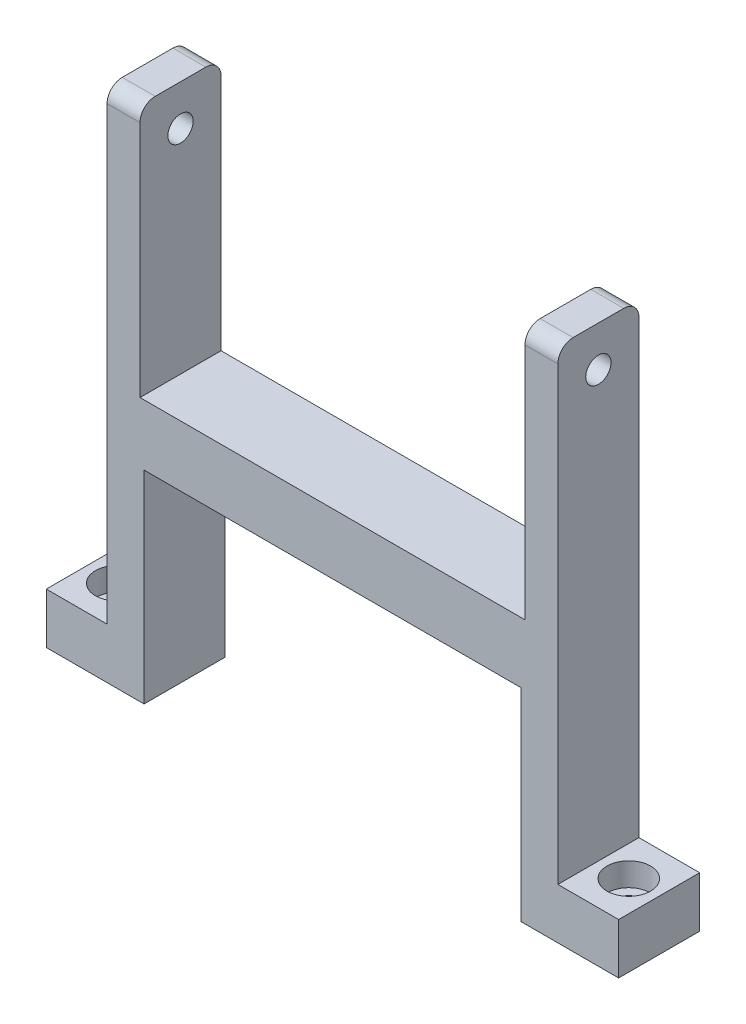
ISO-10303-21;
HEADER;
FILE_DESCRIPTION(('STEP AP214'),'2;1');
FILE_NAME('part.step','',(''),(''),'','','');
FILE_SCHEMA(('AUTOMOTIVE_DESIGN { 1 0 10303 214 1 1 1 1 }'));
ENDSEC;
DATA;
#1=APPLICATION_CONTEXT('core data for automotive mechanical design processes');
#2=APPLICATION_PROTOCOL_DEFINITION('international standard','automotive_design',2000,#1);
#3=PRODUCT_CONTEXT('',#1,'mechanical');
#4=PRODUCT('Part','Part','',(#3));
#5=PRODUCT_RELATED_PRODUCT_CATEGORY('part','',(#4));
#6=PRODUCT_DEFINITION_FORMATION('','',#4);
#7=PRODUCT_DEFINITION_CONTEXT('part definition',#1,'design');
#8=PRODUCT_DEFINITION('design','',#6,#7);
#9=PRODUCT_DEFINITION_SHAPE('','',#8);
#10=(LENGTH_UNIT() NAMED_UNIT(*) SI_UNIT(.MILLI.,.METRE.));
#11=(NAMED_UNIT(*) PLANE_ANGLE_UNIT() SI_UNIT($,.RADIAN.));
#12=(NAMED_UNIT(*) SI_UNIT($,.STERADIAN.) SOLID_ANGLE_UNIT());
#13=UNCERTAINTY_MEASURE_WITH_UNIT(LENGTH_MEASURE(1.E-05),#10,'distance_accuracy_value','');
#14=(GEOMETRIC_REPRESENTATION_CONTEXT(3) GLOBAL_UNCERTAINTY_ASSIGNED_CONTEXT((#13)) GLOBAL_UNIT_ASSIGNED_CONTEXT((#10,
#11,#12)) REPRESENTATION_CONTEXT('',''));
#15=CARTESIAN_POINT('',(0.,0.,0.));
#16=DIRECTION('',(0.,0.,1.));
#17=DIRECTION('',(1.,0.,0.));
#18=AXIS2_PLACEMENT_3D('',#15,#16,#17);
#19=CARTESIAN_POINT('',(22.25,-25.5,8.));
#20=DIRECTION('',(-1.,0.,0.));
#21=DIRECTION('',(0.,0.,1.));
#22=AXIS2_PLACEMENT_3D('',#19,#20,#21);
#23=PLANE('',#22);
#24=CARTESIAN_POINT('',(22.25,21.5,4.));
#25=DIRECTION('',(-1.,0.,0.));
#26=DIRECTION('',(0.,0.,1.));
#27=AXIS2_PLACEMENT_3D('',#24,#25,#26);
#28=CIRCLE('',#27,1.24999999999999);
#29=CARTESIAN_POINT('',(22.25,21.5,5.24999999999999));
#30=VERTEX_POINT('',#29);
#31=EDGE_CURVE('E251',#30,#30,#28,.T.);
#32=ORIENTED_EDGE('',*,*,#31,.T.);
#33=EDGE_LOOP('',(#32));
#34=FACE_BOUND('',#33,.T.);
#35=DIRECTION('',(0.,0.,1.));
#36=VECTOR('',#35,1.);
#37=CARTESIAN_POINT('',(22.25,-20.5,8.));
#38=LINE('',#37,#36);
#39=CARTESIAN_POINT('',(22.25,-20.5,0.));
#40=VERTEX_POINT('',#39);
#41=CARTESIAN_POINT('',(22.25,-20.5,8.));
#42=VERTEX_POINT('',#41);
#43=EDGE_CURVE('E53',#40,#42,#38,.T.);
#44=ORIENTED_EDGE('',*,*,#43,.F.);
#45=DIRECTION('',(0.,1.,0.));
#46=VECTOR('',#45,1.);
#47=CARTESIAN_POINT('',(22.25,-25.5,0.));
#48=LINE('',#47,#46);
#49=CARTESIAN_POINT('',(22.25,24.,0.));
#50=VERTEX_POINT('',#49);
#51=EDGE_CURVE('E198',#40,#50,#48,.T.);
#52=ORIENTED_EDGE('',*,*,#51,.T.);
#53=CARTESIAN_POINT('',(22.25,24.,1.5));
#54=DIRECTION('',(-1.,0.,0.));
#55=DIRECTION('',(0.,0.,1.));
#56=AXIS2_PLACEMENT_3D('',#53,#54,#55);
#57=CIRCLE('',#56,1.5);
#58=CARTESIAN_POINT('',(22.25,25.5,1.5));
#59=VERTEX_POINT('',#58);
#60=EDGE_CURVE('E325',#50,#59,#57,.F.);
#61=ORIENTED_EDGE('',*,*,#60,.T.);
#62=DIRECTION('',(0.,0.,-1.));
#63=VECTOR('',#62,1.);
#64=CARTESIAN_POINT('',(22.25,25.5,8.));
#65=LINE('',#64,#63);
#66=CARTESIAN_POINT('',(22.25,25.5,6.5));
#67=VERTEX_POINT('',#66);
#68=EDGE_CURVE('E305',#67,#59,#65,.T.);
#69=ORIENTED_EDGE('',*,*,#68,.F.);
#70=CARTESIAN_POINT('',(22.25,24.,6.5));
#71=DIRECTION('',(-1.,0.,0.));
#72=DIRECTION('',(0.,0.,1.));
#73=AXIS2_PLACEMENT_3D('',#70,#71,#72);
#74=CIRCLE('',#73,1.5);
#75=CARTESIAN_POINT('',(22.25,24.,8.));
#76=VERTEX_POINT('',#75);
#77=EDGE_CURVE('E327',#67,#76,#74,.F.);
#78=ORIENTED_EDGE('',*,*,#77,.T.);
#79=DIRECTION('',(0.,1.,0.));
#80=VECTOR('',#79,1.);
#81=CARTESIAN_POINT('',(22.25,-25.5,8.));
#82=LINE('',#81,#80);
#83=EDGE_CURVE('E293',#42,#76,#82,.T.);
#84=ORIENTED_EDGE('',*,*,#83,.F.);
#85=EDGE_LOOP('',(#44,#52,#61,#69,#78,#84));
#86=FACE_BOUND('',#85,.T.);
#87=ADVANCED_FACE('F38',(#34,#86),#23,.F.);
#88=CARTESIAN_POINT('',(22.25,-25.5,8.));
#89=DIRECTION('',(0.,1.,0.));
#90=DIRECTION('',(-1.,0.,0.));
#91=AXIS2_PLACEMENT_3D('',#88,#89,#90);
#92=PLANE('',#91);
#93=CARTESIAN_POINT('',(25.25,-25.5,4.));
#94=DIRECTION('',(0.,1.,0.));
#95=DIRECTION('',(0.,0.,1.));
#96=AXIS2_PLACEMENT_3D('',#93,#94,#95);
#97=CIRCLE('',#96,1.2);
#98=CARTESIAN_POINT('',(25.25,-25.5,5.2));
#99=VERTEX_POINT('',#98);
#100=EDGE_CURVE('E701',#99,#99,#97,.T.);
#101=ORIENTED_EDGE('',*,*,#100,.T.);
#102=EDGE_LOOP('',(#101));
#103=FACE_BOUND('',#102,.T.);
#104=DIRECTION('',(1.,0.,0.));
#105=VECTOR('',#104,1.);
#106=CARTESIAN_POINT('',(22.25,-25.5,8.));
#107=LINE('',#106,#105);
#108=CARTESIAN_POINT('',(18.6,-25.5,8.));
#109=VERTEX_POINT('',#108);
#110=CARTESIAN_POINT('',(28.25,-25.5,8.));
#111=VERTEX_POINT('',#110);
#112=EDGE_CURVE('E289',#109,#111,#107,.T.);
#113=ORIENTED_EDGE('',*,*,#112,.F.);
#114=DIRECTION('',(0.,0.,-1.));
#115=VECTOR('',#114,1.);
#116=CARTESIAN_POINT('',(18.6,-25.5,15.));
#117=LINE('',#116,#115);
#118=CARTESIAN_POINT('',(18.6,-25.5,0.));
#119=VERTEX_POINT('',#118);
#120=EDGE_CURVE('E234',#109,#119,#117,.T.);
#121=ORIENTED_EDGE('',*,*,#120,.T.);
#122=DIRECTION('',(1.,0.,0.));
#123=VECTOR('',#122,1.);
#124=CARTESIAN_POINT('',(22.25,-25.5,0.));
#125=LINE('',#124,#123);
#126=CARTESIAN_POINT('',(28.25,-25.5,0.));
#127=VERTEX_POINT('',#126);
#128=EDGE_CURVE('E298',#119,#127,#125,.T.);
#129=ORIENTED_EDGE('',*,*,#128,.T.);
#130=DIRECTION('',(0.,0.,-1.));
#131=VECTOR('',#130,1.);
#132=CARTESIAN_POINT('',(28.25,-25.5,0.));
#133=LINE('',#132,#131);
#134=EDGE_CURVE('E191',#111,#127,#133,.T.);
#135=ORIENTED_EDGE('',*,*,#134,.F.);
#136=EDGE_LOOP('',(#113,#121,#129,#135));
#137=FACE_BOUND('',#136,.T.);
#138=ADVANCED_FACE('F393',(#103,#137),#92,.F.);
#139=CARTESIAN_POINT('',(22.25,25.5,8.));
#140=DIRECTION('',(0.,-1.,0.));
#141=DIRECTION('',(1.,0.,0.));
#142=AXIS2_PLACEMENT_3D('',#139,#140,#141);
#143=PLANE('',#142);
#144=DIRECTION('',(0.,0.,1.));
#145=VECTOR('',#144,1.);
#146=CARTESIAN_POINT('',(19.,25.5,0.));
#147=LINE('',#146,#145);
#148=CARTESIAN_POINT('',(19.,25.5,1.5));
#149=VERTEX_POINT('',#148);
#150=CARTESIAN_POINT('',(19.,25.5,6.5));
#151=VERTEX_POINT('',#150);
#152=EDGE_CURVE('E275',#149,#151,#147,.T.);
#153=ORIENTED_EDGE('',*,*,#152,.T.);
#154=DIRECTION('',(-1.,0.,0.));
#155=VECTOR('',#154,1.);
#156=CARTESIAN_POINT('',(22.25,25.5,6.5));
#157=LINE('',#156,#155);
#158=EDGE_CURVE('E323',#151,#67,#157,.F.);
#159=ORIENTED_EDGE('',*,*,#158,.T.);
#160=ORIENTED_EDGE('',*,*,#68,.T.);
#161=DIRECTION('',(-1.,0.,0.));
#162=VECTOR('',#161,1.);
#163=CARTESIAN_POINT('',(22.25,25.5,1.5));
#164=LINE('',#163,#162);
#165=EDGE_CURVE('E320',#59,#149,#164,.T.);
#166=ORIENTED_EDGE('',*,*,#165,.T.);
#167=EDGE_LOOP('',(#153,#159,#160,#166));
#168=FACE_BOUND('',#167,.T.);
#169=ADVANCED_FACE('F387',(#168),#143,.F.);
#170=CARTESIAN_POINT('',(-22.25,-25.5,8.));
#171=DIRECTION('',(1.,0.,0.));
#172=DIRECTION('',(0.,0.,-1.));
#173=AXIS2_PLACEMENT_3D('',#170,#171,#172);
#174=PLANE('',#173);
#175=CARTESIAN_POINT('',(-22.25,21.5,4.));
#176=DIRECTION('',(-1.,0.,0.));
#177=DIRECTION('',(0.,0.,1.));
#178=AXIS2_PLACEMENT_3D('',#175,#176,#177);
#179=CIRCLE('',#178,1.24999999999999);
#180=CARTESIAN_POINT('',(-22.25,21.5,5.24999999999999));
#181=VERTEX_POINT('',#180);
#182=EDGE_CURVE('E248',#181,#181,#179,.T.);
#183=ORIENTED_EDGE('',*,*,#182,.F.);
#184=EDGE_LOOP('',(#183));
#185=FACE_BOUND('',#184,.T.);
#186=DIRECTION('',(0.,-1.,0.));
#187=VECTOR('',#186,1.);
#188=CARTESIAN_POINT('',(-22.25,-25.5,0.));
#189=LINE('',#188,#187);
#190=CARTESIAN_POINT('',(-22.25,24.,0.));
#191=VERTEX_POINT('',#190);
#192=CARTESIAN_POINT('',(-22.25,-20.5,0.));
#193=VERTEX_POINT('',#192);
#194=EDGE_CURVE('E278',#191,#193,#189,.T.);
#195=ORIENTED_EDGE('',*,*,#194,.T.);
#196=DIRECTION('',(0.,0.,1.));
#197=VECTOR('',#196,1.);
#198=CARTESIAN_POINT('',(-22.25,-20.5,8.));
#199=LINE('',#198,#197);
#200=CARTESIAN_POINT('',(-22.25,-20.5,8.));
#201=VERTEX_POINT('',#200);
#202=EDGE_CURVE('E208',#193,#201,#199,.T.);
#203=ORIENTED_EDGE('',*,*,#202,.T.);
#204=DIRECTION('',(0.,-1.,0.));
#205=VECTOR('',#204,1.);
#206=CARTESIAN_POINT('',(-22.25,-25.5,8.));
#207=LINE('',#206,#205);
#208=CARTESIAN_POINT('',(-22.25,24.,8.));
#209=VERTEX_POINT('',#208);
#210=EDGE_CURVE('E286',#209,#201,#207,.T.);
#211=ORIENTED_EDGE('',*,*,#210,.F.);
#212=CARTESIAN_POINT('',(-22.25,24.,6.5));
#213=DIRECTION('',(1.,0.,0.));
#214=DIRECTION('',(0.,0.,-1.));
#215=AXIS2_PLACEMENT_3D('',#212,#213,#214);
#216=CIRCLE('',#215,1.5);
#217=CARTESIAN_POINT('',(-22.25,25.5,6.5));
#218=VERTEX_POINT('',#217);
#219=EDGE_CURVE('E336',#209,#218,#216,.F.);
#220=ORIENTED_EDGE('',*,*,#219,.T.);
#221=DIRECTION('',(0.,0.,-1.));
#222=VECTOR('',#221,1.);
#223=CARTESIAN_POINT('',(-22.25,25.5,8.));
#224=LINE('',#223,#222);
#225=CARTESIAN_POINT('',(-22.25,25.5,1.5));
#226=VERTEX_POINT('',#225);
#227=EDGE_CURVE('E295',#218,#226,#224,.T.);
#228=ORIENTED_EDGE('',*,*,#227,.T.);
#229=CARTESIAN_POINT('',(-22.25,24.,1.5));
#230=DIRECTION('',(1.,0.,0.));
#231=DIRECTION('',(0.,0.,-1.));
#232=AXIS2_PLACEMENT_3D('',#229,#230,#231);
#233=CIRCLE('',#232,1.5);
#234=EDGE_CURVE('E334',#226,#191,#233,.F.);
#235=ORIENTED_EDGE('',*,*,#234,.T.);
#236=EDGE_LOOP('',(#195,#203,#211,#220,#228,#235));
#237=FACE_BOUND('',#236,.T.);
#238=ADVANCED_FACE('F358',(#185,#237),#174,.F.);
#239=CARTESIAN_POINT('',(-25.25,-25.5,4.));
#240=DIRECTION('',(0.,1.,0.));
#241=DIRECTION('',(0.,0.,1.));
#242=AXIS2_PLACEMENT_3D('',#239,#240,#241);
#243=CIRCLE('',#242,1.2);
#244=CARTESIAN_POINT('',(-25.25,-25.5,5.2));
#245=VERTEX_POINT('',#244);
#246=EDGE_CURVE('E205',#245,#245,#243,.T.);
#247=ORIENTED_EDGE('',*,*,#246,.T.);
#248=EDGE_LOOP('',(#247));
#249=FACE_BOUND('',#248,.T.);
#250=CARTESIAN_POINT('',(-28.25,-25.5,0.));
#251=VERTEX_POINT('',#250);
#252=CARTESIAN_POINT('',(-18.6,-25.5,0.));
#253=VERTEX_POINT('',#252);
#254=EDGE_CURVE('E299',#251,#253,#125,.T.);
#255=ORIENTED_EDGE('',*,*,#254,.T.);
#256=DIRECTION('',(0.,0.,-1.));
#257=VECTOR('',#256,1.);
#258=CARTESIAN_POINT('',(-18.6,-25.5,15.));
#259=LINE('',#258,#257);
#260=CARTESIAN_POINT('',(-18.6,-25.5,8.));
#261=VERTEX_POINT('',#260);
#262=EDGE_CURVE('E233',#261,#253,#259,.T.);
#263=ORIENTED_EDGE('',*,*,#262,.F.);
#264=CARTESIAN_POINT('',(-28.25,-25.5,8.));
#265=VERTEX_POINT('',#264);
#266=EDGE_CURVE('E290',#265,#261,#107,.T.);
#267=ORIENTED_EDGE('',*,*,#266,.F.);
#268=DIRECTION('',(0.,0.,-1.));
#269=VECTOR('',#268,1.);
#270=CARTESIAN_POINT('',(-28.25,-25.5,0.));
#271=LINE('',#270,#269);
#272=EDGE_CURVE('E206',#265,#251,#271,.T.);
#273=ORIENTED_EDGE('',*,*,#272,.T.);
#274=EDGE_LOOP('',(#255,#263,#267,#273));
#275=FACE_BOUND('',#274,.T.);
#276=ADVANCED_FACE('F409',(#249,#275),#92,.F.);
#277=ORIENTED_EDGE('',*,*,#227,.F.);
#278=DIRECTION('',(-1.,0.,0.));
#279=VECTOR('',#278,1.);
#280=CARTESIAN_POINT('',(-19.,25.5,6.5));
#281=LINE('',#280,#279);
#282=CARTESIAN_POINT('',(-19.,25.5,6.5));
#283=VERTEX_POINT('',#282);
#284=EDGE_CURVE('E341',#218,#283,#281,.F.);
#285=ORIENTED_EDGE('',*,*,#284,.T.);
#286=DIRECTION('',(0.,0.,1.));
#287=VECTOR('',#286,1.);
#288=CARTESIAN_POINT('',(-19.,25.5,0.));
#289=LINE('',#288,#287);
#290=CARTESIAN_POINT('',(-19.,25.5,1.5));
#291=VERTEX_POINT('',#290);
#292=EDGE_CURVE('E268',#291,#283,#289,.T.);
#293=ORIENTED_EDGE('',*,*,#292,.F.);
#294=DIRECTION('',(-1.,0.,0.));
#295=VECTOR('',#294,1.);
#296=CARTESIAN_POINT('',(22.25,25.5,1.5));
#297=LINE('',#296,#295);
#298=EDGE_CURVE('E338',#291,#226,#297,.T.);
#299=ORIENTED_EDGE('',*,*,#298,.T.);
#300=EDGE_LOOP('',(#277,#285,#293,#299));
#301=FACE_BOUND('',#300,.T.);
#302=ADVANCED_FACE('F354',(#301),#143,.F.);
#303=CARTESIAN_POINT('',(0.,0.,8.));
#304=DIRECTION('',(0.,0.,1.));
#305=DIRECTION('',(1.,0.,0.));
#306=AXIS2_PLACEMENT_3D('',#303,#304,#305);
#307=PLANE('',#306);
#308=DIRECTION('',(0.,1.,0.));
#309=VECTOR('',#308,1.);
#310=CARTESIAN_POINT('',(18.6,0.,8.));
#311=LINE('',#310,#309);
#312=CARTESIAN_POINT('',(18.6,-5.5,8.));
#313=VERTEX_POINT('',#312);
#314=EDGE_CURVE('E246',#109,#313,#311,.T.);
#315=ORIENTED_EDGE('',*,*,#314,.F.);
#316=ORIENTED_EDGE('',*,*,#112,.T.);
#317=DIRECTION('',(0.,-1.,0.));
#318=VECTOR('',#317,1.);
#319=CARTESIAN_POINT('',(28.25,-20.5,8.));
#320=LINE('',#319,#318);
#321=CARTESIAN_POINT('',(28.25,-20.5,8.));
#322=VERTEX_POINT('',#321);
#323=EDGE_CURVE('E194',#322,#111,#320,.T.);
#324=ORIENTED_EDGE('',*,*,#323,.F.);
#325=DIRECTION('',(1.,0.,0.));
#326=VECTOR('',#325,1.);
#327=CARTESIAN_POINT('',(28.25,-20.5,8.));
#328=LINE('',#327,#326);
#329=EDGE_CURVE('E181',#42,#322,#328,.T.);
#330=ORIENTED_EDGE('',*,*,#329,.F.);
#331=ORIENTED_EDGE('',*,*,#83,.T.);
#332=DIRECTION('',(-1.,0.,0.));
#333=VECTOR('',#332,1.);
#334=CARTESIAN_POINT('',(19.,24.,8.));
#335=LINE('',#334,#333);
#336=CARTESIAN_POINT('',(19.,24.,8.));
#337=VERTEX_POINT('',#336);
#338=EDGE_CURVE('E313',#76,#337,#335,.T.);
#339=ORIENTED_EDGE('',*,*,#338,.T.);
#340=DIRECTION('',(0.,1.,0.));
#341=VECTOR('',#340,1.);
#342=CARTESIAN_POINT('',(19.,0.500000000000011,8.));
#343=LINE('',#342,#341);
#344=CARTESIAN_POINT('',(19.,0.500000000000011,8.));
#345=VERTEX_POINT('',#344);
#346=EDGE_CURVE('E262',#345,#337,#343,.T.);
#347=ORIENTED_EDGE('',*,*,#346,.F.);
#348=DIRECTION('',(1.,0.,0.));
#349=VECTOR('',#348,1.);
#350=CARTESIAN_POINT('',(-19.,0.500000000000011,8.));
#351=LINE('',#350,#349);
#352=CARTESIAN_POINT('',(-19.,0.500000000000011,8.));
#353=VERTEX_POINT('',#352);
#354=EDGE_CURVE('E270',#353,#345,#351,.T.);
#355=ORIENTED_EDGE('',*,*,#354,.F.);
#356=DIRECTION('',(0.,-1.,0.));
#357=VECTOR('',#356,1.);
#358=CARTESIAN_POINT('',(-19.,25.5,8.));
#359=LINE('',#358,#357);
#360=CARTESIAN_POINT('',(-19.,24.,8.));
#361=VERTEX_POINT('',#360);
#362=EDGE_CURVE('E258',#361,#353,#359,.T.);
#363=ORIENTED_EDGE('',*,*,#362,.F.);
#364=DIRECTION('',(-1.,0.,0.));
#365=VECTOR('',#364,1.);
#366=CARTESIAN_POINT('',(-22.25,24.,8.));
#367=LINE('',#366,#365);
#368=EDGE_CURVE('E308',#361,#209,#367,.T.);
#369=ORIENTED_EDGE('',*,*,#368,.T.);
#370=ORIENTED_EDGE('',*,*,#210,.T.);
#371=DIRECTION('',(-1.,0.,0.));
#372=VECTOR('',#371,1.);
#373=CARTESIAN_POINT('',(-28.25,-20.5,8.));
#374=LINE('',#373,#372);
#375=CARTESIAN_POINT('',(-28.25,-20.5,8.));
#376=VERTEX_POINT('',#375);
#377=EDGE_CURVE('E61',#201,#376,#374,.T.);
#378=ORIENTED_EDGE('',*,*,#377,.T.);
#379=DIRECTION('',(0.,-1.,0.));
#380=VECTOR('',#379,1.);
#381=CARTESIAN_POINT('',(-28.25,-20.5,8.));
#382=LINE('',#381,#380);
#383=EDGE_CURVE('E217',#376,#265,#382,.T.);
#384=ORIENTED_EDGE('',*,*,#383,.T.);
#385=ORIENTED_EDGE('',*,*,#266,.T.);
#386=DIRECTION('',(0.,-1.,0.));
#387=VECTOR('',#386,1.);
#388=CARTESIAN_POINT('',(-18.6,0.,8.));
#389=LINE('',#388,#387);
#390=CARTESIAN_POINT('',(-18.6,-5.5,8.));
#391=VERTEX_POINT('',#390);
#392=EDGE_CURVE('E237',#391,#261,#389,.T.);
#393=ORIENTED_EDGE('',*,*,#392,.F.);
#394=DIRECTION('',(-1.,0.,0.));
#395=VECTOR('',#394,1.);
#396=CARTESIAN_POINT('',(0.,-5.5,8.));
#397=LINE('',#396,#395);
#398=EDGE_CURVE('E244',#313,#391,#397,.T.);
#399=ORIENTED_EDGE('',*,*,#398,.F.);
#400=EDGE_LOOP('',(#315,#316,#324,#330,#331,#339,#347,#355,#363,#369,#370,#378,#384,#385,#393,#399));
#401=FACE_BOUND('',#400,.T.);
#402=ADVANCED_FACE('F364',(#401),#307,.T.);
#403=CARTESIAN_POINT('',(0.,0.,0.));
#404=DIRECTION('',(0.,0.,1.));
#405=DIRECTION('',(1.,0.,0.));
#406=AXIS2_PLACEMENT_3D('',#403,#404,#405);
#407=PLANE('',#406);
#408=ORIENTED_EDGE('',*,*,#128,.F.);
#409=DIRECTION('',(0.,-1.,0.));
#410=VECTOR('',#409,1.);
#411=CARTESIAN_POINT('',(18.6,-5.5,0.));
#412=LINE('',#411,#410);
#413=CARTESIAN_POINT('',(18.6,-5.5,0.));
#414=VERTEX_POINT('',#413);
#415=EDGE_CURVE('E231',#414,#119,#412,.T.);
#416=ORIENTED_EDGE('',*,*,#415,.F.);
#417=DIRECTION('',(1.,0.,0.));
#418=VECTOR('',#417,1.);
#419=CARTESIAN_POINT('',(-18.6,-5.5,0.));
#420=LINE('',#419,#418);
#421=CARTESIAN_POINT('',(-18.6,-5.5,0.));
#422=VERTEX_POINT('',#421);
#423=EDGE_CURVE('E228',#422,#414,#420,.T.);
#424=ORIENTED_EDGE('',*,*,#423,.F.);
#425=DIRECTION('',(0.,1.,0.));
#426=VECTOR('',#425,1.);
#427=CARTESIAN_POINT('',(-18.6,-25.5,0.));
#428=LINE('',#427,#426);
#429=EDGE_CURVE('E223',#253,#422,#428,.T.);
#430=ORIENTED_EDGE('',*,*,#429,.F.);
#431=ORIENTED_EDGE('',*,*,#254,.F.);
#432=DIRECTION('',(0.,-1.,0.));
#433=VECTOR('',#432,1.);
#434=CARTESIAN_POINT('',(-28.25,-20.5,0.));
#435=LINE('',#434,#433);
#436=CARTESIAN_POINT('',(-28.25,-20.5,0.));
#437=VERTEX_POINT('',#436);
#438=EDGE_CURVE('E220',#437,#251,#435,.T.);
#439=ORIENTED_EDGE('',*,*,#438,.F.);
#440=DIRECTION('',(1.,0.,0.));
#441=VECTOR('',#440,1.);
#442=CARTESIAN_POINT('',(-22.25,-20.5,0.));
#443=LINE('',#442,#441);
#444=EDGE_CURVE('E214',#437,#193,#443,.T.);
#445=ORIENTED_EDGE('',*,*,#444,.T.);
#446=ORIENTED_EDGE('',*,*,#194,.F.);
#447=DIRECTION('',(-1.,0.,0.));
#448=VECTOR('',#447,1.);
#449=CARTESIAN_POINT('',(0.,24.,0.));
#450=LINE('',#449,#448);
#451=CARTESIAN_POINT('',(-19.,24.,0.));
#452=VERTEX_POINT('',#451);
#453=EDGE_CURVE('E330',#191,#452,#450,.F.);
#454=ORIENTED_EDGE('',*,*,#453,.T.);
#455=DIRECTION('',(0.,-1.,0.));
#456=VECTOR('',#455,1.);
#457=CARTESIAN_POINT('',(-19.,25.5,0.));
#458=LINE('',#457,#456);
#459=CARTESIAN_POINT('',(-19.,0.500000000000011,0.));
#460=VERTEX_POINT('',#459);
#461=EDGE_CURVE('E259',#452,#460,#458,.T.);
#462=ORIENTED_EDGE('',*,*,#461,.T.);
#463=DIRECTION('',(1.,0.,0.));
#464=VECTOR('',#463,1.);
#465=CARTESIAN_POINT('',(-19.,0.500000000000011,0.));
#466=LINE('',#465,#464);
#467=CARTESIAN_POINT('',(19.,0.500000000000011,0.));
#468=VERTEX_POINT('',#467);
#469=EDGE_CURVE('E261',#460,#468,#466,.T.);
#470=ORIENTED_EDGE('',*,*,#469,.T.);
#471=DIRECTION('',(0.,1.,0.));
#472=VECTOR('',#471,1.);
#473=CARTESIAN_POINT('',(19.,0.500000000000011,0.));
#474=LINE('',#473,#472);
#475=CARTESIAN_POINT('',(19.,24.,0.));
#476=VERTEX_POINT('',#475);
#477=EDGE_CURVE('E265',#468,#476,#474,.T.);
#478=ORIENTED_EDGE('',*,*,#477,.T.);
#479=DIRECTION('',(-1.,0.,0.));
#480=VECTOR('',#479,1.);
#481=CARTESIAN_POINT('',(0.,24.,0.));
#482=LINE('',#481,#480);
#483=EDGE_CURVE('E332',#476,#50,#482,.F.);
#484=ORIENTED_EDGE('',*,*,#483,.T.);
#485=ORIENTED_EDGE('',*,*,#51,.F.);
#486=DIRECTION('',(-1.,0.,0.));
#487=VECTOR('',#486,1.);
#488=CARTESIAN_POINT('',(22.25,-20.5,0.));
#489=LINE('',#488,#487);
#490=CARTESIAN_POINT('',(28.25,-20.5,0.));
#491=VERTEX_POINT('',#490);
#492=EDGE_CURVE('E179',#491,#40,#489,.T.);
#493=ORIENTED_EDGE('',*,*,#492,.F.);
#494=DIRECTION('',(0.,-1.,0.));
#495=VECTOR('',#494,1.);
#496=CARTESIAN_POINT('',(28.25,-20.5,0.));
#497=LINE('',#496,#495);
#498=EDGE_CURVE('E188',#491,#127,#497,.T.);
#499=ORIENTED_EDGE('',*,*,#498,.T.);
#500=EDGE_LOOP('',(#408,#416,#424,#430,#431,#439,#445,#446,#454,#462,#470,#478,#484,#485,#493,#499));
#501=FACE_BOUND('',#500,.T.);
#502=ADVANCED_FACE('F196',(#501),#407,.F.);
#503=CARTESIAN_POINT('',(19.,0.500000000000011,0.));
#504=DIRECTION('',(1.,0.,0.));
#505=DIRECTION('',(0.,0.,-1.));
#506=AXIS2_PLACEMENT_3D('',#503,#504,#505);
#507=PLANE('',#506);
#508=CARTESIAN_POINT('',(19.,21.5,4.));
#509=DIRECTION('',(1.,0.,0.));
#510=DIRECTION('',(0.,0.,-1.));
#511=AXIS2_PLACEMENT_3D('',#508,#509,#510);
#512=CIRCLE('',#511,1.24999999999999);
#513=CARTESIAN_POINT('',(19.,21.5,2.75000000000001));
#514=VERTEX_POINT('',#513);
#515=EDGE_CURVE('E255',#514,#514,#512,.T.);
#516=ORIENTED_EDGE('',*,*,#515,.T.);
#517=EDGE_LOOP('',(#516));
#518=FACE_BOUND('',#517,.T.);
#519=ORIENTED_EDGE('',*,*,#346,.T.);
#520=CARTESIAN_POINT('',(19.,24.,6.5));
#521=DIRECTION('',(1.,0.,0.));
#522=DIRECTION('',(0.,0.,-1.));
#523=AXIS2_PLACEMENT_3D('',#520,#521,#522);
#524=CIRCLE('',#523,1.5);
#525=EDGE_CURVE('E318',#337,#151,#524,.F.);
#526=ORIENTED_EDGE('',*,*,#525,.T.);
#527=ORIENTED_EDGE('',*,*,#152,.F.);
#528=CARTESIAN_POINT('',(19.,24.,1.5));
#529=DIRECTION('',(1.,0.,0.));
#530=DIRECTION('',(0.,0.,-1.));
#531=AXIS2_PLACEMENT_3D('',#528,#529,#530);
#532=CIRCLE('',#531,1.5);
#533=EDGE_CURVE('E316',#149,#476,#532,.F.);
#534=ORIENTED_EDGE('',*,*,#533,.T.);
#535=ORIENTED_EDGE('',*,*,#477,.F.);
#536=DIRECTION('',(0.,0.,1.));
#537=VECTOR('',#536,1.);
#538=CARTESIAN_POINT('',(19.,0.500000000000011,0.));
#539=LINE('',#538,#537);
#540=EDGE_CURVE('E279',#468,#345,#539,.T.);
#541=ORIENTED_EDGE('',*,*,#540,.T.);
#542=EDGE_LOOP('',(#519,#526,#527,#534,#535,#541));
#543=FACE_BOUND('',#542,.T.);
#544=ADVANCED_FACE('F376',(#518,#543),#507,.F.);
#545=CARTESIAN_POINT('',(-19.,0.500000000000011,0.));
#546=DIRECTION('',(0.,-1.,0.));
#547=DIRECTION('',(0.,0.,-1.));
#548=AXIS2_PLACEMENT_3D('',#545,#546,#547);
#549=PLANE('',#548);
#550=ORIENTED_EDGE('',*,*,#354,.T.);
#551=ORIENTED_EDGE('',*,*,#540,.F.);
#552=ORIENTED_EDGE('',*,*,#469,.F.);
#553=DIRECTION('',(0.,0.,1.));
#554=VECTOR('',#553,1.);
#555=CARTESIAN_POINT('',(-19.,0.500000000000011,0.));
#556=LINE('',#555,#554);
#557=EDGE_CURVE('E281',#460,#353,#556,.T.);
#558=ORIENTED_EDGE('',*,*,#557,.T.);
#559=EDGE_LOOP('',(#550,#551,#552,#558));
#560=FACE_BOUND('',#559,.T.);
#561=ADVANCED_FACE('F372',(#560),#549,.F.);
#562=CARTESIAN_POINT('',(-19.,25.5,0.));
#563=DIRECTION('',(-1.,0.,0.));
#564=DIRECTION('',(0.,-1.,0.));
#565=AXIS2_PLACEMENT_3D('',#562,#563,#564);
#566=PLANE('',#565);
#567=CARTESIAN_POINT('',(-19.,21.5,4.));
#568=DIRECTION('',(-1.,0.,0.));
#569=DIRECTION('',(0.,-1.,0.));
#570=AXIS2_PLACEMENT_3D('',#567,#568,#569);
#571=CIRCLE('',#570,1.24999999999999);
#572=CARTESIAN_POINT('',(-19.,20.25,4.));
#573=VERTEX_POINT('',#572);
#574=EDGE_CURVE('E254',#573,#573,#571,.T.);
#575=ORIENTED_EDGE('',*,*,#574,.T.);
#576=EDGE_LOOP('',(#575));
#577=FACE_BOUND('',#576,.T.);
#578=ORIENTED_EDGE('',*,*,#292,.T.);
#579=CARTESIAN_POINT('',(-19.,24.,6.5));
#580=DIRECTION('',(-1.,0.,0.));
#581=DIRECTION('',(0.,-1.,0.));
#582=AXIS2_PLACEMENT_3D('',#579,#580,#581);
#583=CIRCLE('',#582,1.5);
#584=EDGE_CURVE('E11',#283,#361,#583,.F.);
#585=ORIENTED_EDGE('',*,*,#584,.T.);
#586=ORIENTED_EDGE('',*,*,#362,.T.);
#587=ORIENTED_EDGE('',*,*,#557,.F.);
#588=ORIENTED_EDGE('',*,*,#461,.F.);
#589=CARTESIAN_POINT('',(-19.,24.,1.5));
#590=DIRECTION('',(-1.,0.,0.));
#591=DIRECTION('',(0.,-1.,0.));
#592=AXIS2_PLACEMENT_3D('',#589,#590,#591);
#593=CIRCLE('',#592,1.5);
#594=EDGE_CURVE('E46',#452,#291,#593,.F.);
#595=ORIENTED_EDGE('',*,*,#594,.T.);
#596=EDGE_LOOP('',(#578,#585,#586,#587,#588,#595));
#597=FACE_BOUND('',#596,.T.);
#598=ADVANCED_FACE('F346',(#577,#597),#566,.F.);
#599=CARTESIAN_POINT('',(-22.25,21.5,4.));
#600=DIRECTION('',(-1.,0.,0.));
#601=DIRECTION('',(0.,0.,1.));
#602=AXIS2_PLACEMENT_3D('',#599,#600,#601);
#603=CYLINDRICAL_SURFACE('',#602,1.24999999999999);
#604=ORIENTED_EDGE('',*,*,#182,.T.);
#605=EDGE_LOOP('',(#604));
#606=FACE_BOUND('',#605,.T.);
#607=ORIENTED_EDGE('',*,*,#574,.F.);
#608=EDGE_LOOP('',(#607));
#609=FACE_BOUND('',#608,.T.);
#610=ADVANCED_FACE('F457',(#606,#609),#603,.F.);
#611=ORIENTED_EDGE('',*,*,#31,.F.);
#612=EDGE_LOOP('',(#611));
#613=FACE_BOUND('',#612,.T.);
#614=ORIENTED_EDGE('',*,*,#515,.F.);
#615=EDGE_LOOP('',(#614));
#616=FACE_BOUND('',#615,.T.);
#617=ADVANCED_FACE('F441',(#613,#616),#603,.F.);
#618=CARTESIAN_POINT('',(0.,24.,6.5));
#619=DIRECTION('',(1.,0.,0.));
#620=DIRECTION('',(0.,1.,0.));
#621=AXIS2_PLACEMENT_3D('',#618,#619,#620);
#622=CYLINDRICAL_SURFACE('',#621,1.5);
#623=ORIENTED_EDGE('',*,*,#77,.F.);
#624=ORIENTED_EDGE('',*,*,#158,.F.);
#625=ORIENTED_EDGE('',*,*,#525,.F.);
#626=ORIENTED_EDGE('',*,*,#338,.F.);
#627=EDGE_LOOP('',(#623,#624,#625,#626));
#628=FACE_BOUND('',#627,.T.);
#629=ADVANCED_FACE('F390',(#628),#622,.T.);
#630=CARTESIAN_POINT('',(22.25,24.,1.5));
#631=DIRECTION('',(-1.,0.,0.));
#632=DIRECTION('',(0.,-1.,0.));
#633=AXIS2_PLACEMENT_3D('',#630,#631,#632);
#634=CYLINDRICAL_SURFACE('',#633,1.5);
#635=ORIENTED_EDGE('',*,*,#60,.F.);
#636=ORIENTED_EDGE('',*,*,#483,.F.);
#637=ORIENTED_EDGE('',*,*,#533,.F.);
#638=ORIENTED_EDGE('',*,*,#165,.F.);
#639=EDGE_LOOP('',(#635,#636,#637,#638));
#640=FACE_BOUND('',#639,.T.);
#641=ADVANCED_FACE('F382',(#640),#634,.T.);
#642=CARTESIAN_POINT('',(0.,24.,6.5));
#643=DIRECTION('',(1.,0.,0.));
#644=DIRECTION('',(0.,1.,0.));
#645=AXIS2_PLACEMENT_3D('',#642,#643,#644);
#646=CYLINDRICAL_SURFACE('',#645,1.5);
#647=ORIENTED_EDGE('',*,*,#584,.F.);
#648=ORIENTED_EDGE('',*,*,#284,.F.);
#649=ORIENTED_EDGE('',*,*,#219,.F.);
#650=ORIENTED_EDGE('',*,*,#368,.F.);
#651=EDGE_LOOP('',(#647,#648,#649,#650));
#652=FACE_BOUND('',#651,.T.);
#653=ADVANCED_FACE('F369',(#652),#646,.T.);
#654=CARTESIAN_POINT('',(22.25,24.,1.5));
#655=DIRECTION('',(-1.,0.,0.));
#656=DIRECTION('',(0.,-1.,0.));
#657=AXIS2_PLACEMENT_3D('',#654,#655,#656);
#658=CYLINDRICAL_SURFACE('',#657,1.5);
#659=ORIENTED_EDGE('',*,*,#594,.F.);
#660=ORIENTED_EDGE('',*,*,#453,.F.);
#661=ORIENTED_EDGE('',*,*,#234,.F.);
#662=ORIENTED_EDGE('',*,*,#298,.F.);
#663=EDGE_LOOP('',(#659,#660,#661,#662));
#664=FACE_BOUND('',#663,.T.);
#665=ADVANCED_FACE('F40',(#664),#658,.T.);
#666=CARTESIAN_POINT('',(18.6,-5.5,15.));
#667=DIRECTION('',(1.,0.,0.));
#668=DIRECTION('',(0.,0.,-1.));
#669=AXIS2_PLACEMENT_3D('',#666,#667,#668);
#670=PLANE('',#669);
#671=ORIENTED_EDGE('',*,*,#314,.T.);
#672=DIRECTION('',(0.,0.,-1.));
#673=VECTOR('',#672,1.);
#674=CARTESIAN_POINT('',(18.6,-5.5,15.));
#675=LINE('',#674,#673);
#676=EDGE_CURVE('E238',#313,#414,#675,.T.);
#677=ORIENTED_EDGE('',*,*,#676,.T.);
#678=ORIENTED_EDGE('',*,*,#415,.T.);
#679=ORIENTED_EDGE('',*,*,#120,.F.);
#680=EDGE_LOOP('',(#671,#677,#678,#679));
#681=FACE_BOUND('',#680,.T.);
#682=ADVANCED_FACE('F398',(#681),#670,.F.);
#683=CARTESIAN_POINT('',(-18.6,-5.5,15.));
#684=DIRECTION('',(0.,1.,0.));
#685=DIRECTION('',(-1.,0.,0.));
#686=AXIS2_PLACEMENT_3D('',#683,#684,#685);
#687=PLANE('',#686);
#688=ORIENTED_EDGE('',*,*,#398,.T.);
#689=DIRECTION('',(0.,0.,-1.));
#690=VECTOR('',#689,1.);
#691=CARTESIAN_POINT('',(-18.6,-5.5,15.));
#692=LINE('',#691,#690);
#693=EDGE_CURVE('E240',#391,#422,#692,.T.);
#694=ORIENTED_EDGE('',*,*,#693,.T.);
#695=ORIENTED_EDGE('',*,*,#423,.T.);
#696=ORIENTED_EDGE('',*,*,#676,.F.);
#697=EDGE_LOOP('',(#688,#694,#695,#696));
#698=FACE_BOUND('',#697,.T.);
#699=ADVANCED_FACE('F402',(#698),#687,.F.);
#700=CARTESIAN_POINT('',(-18.6,-25.5,15.));
#701=DIRECTION('',(-1.,0.,0.));
#702=DIRECTION('',(0.,0.,1.));
#703=AXIS2_PLACEMENT_3D('',#700,#701,#702);
#704=PLANE('',#703);
#705=ORIENTED_EDGE('',*,*,#392,.T.);
#706=ORIENTED_EDGE('',*,*,#262,.T.);
#707=ORIENTED_EDGE('',*,*,#429,.T.);
#708=ORIENTED_EDGE('',*,*,#693,.F.);
#709=EDGE_LOOP('',(#705,#706,#707,#708));
#710=FACE_BOUND('',#709,.T.);
#711=ADVANCED_FACE('F406',(#710),#704,.F.);
#712=CARTESIAN_POINT('',(-28.25,-20.5,0.));
#713=DIRECTION('',(-1.,0.,0.));
#714=DIRECTION('',(0.,-1.,0.));
#715=AXIS2_PLACEMENT_3D('',#712,#713,#714);
#716=PLANE('',#715);
#717=ORIENTED_EDGE('',*,*,#272,.F.);
#718=ORIENTED_EDGE('',*,*,#383,.F.);
#719=DIRECTION('',(0.,0.,-1.));
#720=VECTOR('',#719,1.);
#721=CARTESIAN_POINT('',(-28.25,-20.5,0.));
#722=LINE('',#721,#720);
#723=EDGE_CURVE('E211',#376,#437,#722,.T.);
#724=ORIENTED_EDGE('',*,*,#723,.T.);
#725=ORIENTED_EDGE('',*,*,#438,.T.);
#726=EDGE_LOOP('',(#717,#718,#724,#725));
#727=FACE_BOUND('',#726,.T.);
#728=ADVANCED_FACE('F412',(#727),#716,.T.);
#729=CARTESIAN_POINT('',(0.,-20.5,0.));
#730=DIRECTION('',(0.,1.,0.));
#731=DIRECTION('',(-1.,0.,0.));
#732=AXIS2_PLACEMENT_3D('',#729,#730,#731);
#733=PLANE('',#732);
#734=CARTESIAN_POINT('',(-25.25,-20.5,4.));
#735=DIRECTION('',(0.,1.,0.));
#736=DIRECTION('',(0.,0.,1.));
#737=AXIS2_PLACEMENT_3D('',#734,#735,#736);
#738=CIRCLE('',#737,2.15);
#739=CARTESIAN_POINT('',(-25.25,-20.5,6.15));
#740=VERTEX_POINT('',#739);
#741=EDGE_CURVE('E704',#740,#740,#738,.T.);
#742=ORIENTED_EDGE('',*,*,#741,.F.);
#743=EDGE_LOOP('',(#742));
#744=FACE_BOUND('',#743,.T.);
#745=ORIENTED_EDGE('',*,*,#202,.F.);
#746=ORIENTED_EDGE('',*,*,#444,.F.);
#747=ORIENTED_EDGE('',*,*,#723,.F.);
#748=ORIENTED_EDGE('',*,*,#377,.F.);
#749=EDGE_LOOP('',(#745,#746,#747,#748));
#750=FACE_BOUND('',#749,.T.);
#751=ADVANCED_FACE('F360',(#744,#750),#733,.T.);
#752=CARTESIAN_POINT('',(28.25,-20.5,0.));
#753=DIRECTION('',(-1.,0.,0.));
#754=DIRECTION('',(0.,-1.,0.));
#755=AXIS2_PLACEMENT_3D('',#752,#753,#754);
#756=PLANE('',#755);
#757=ORIENTED_EDGE('',*,*,#134,.T.);
#758=ORIENTED_EDGE('',*,*,#498,.F.);
#759=DIRECTION('',(0.,0.,-1.));
#760=VECTOR('',#759,1.);
#761=CARTESIAN_POINT('',(28.25,-20.5,0.));
#762=LINE('',#761,#760);
#763=EDGE_CURVE('E175',#322,#491,#762,.T.);
#764=ORIENTED_EDGE('',*,*,#763,.F.);
#765=ORIENTED_EDGE('',*,*,#323,.T.);
#766=EDGE_LOOP('',(#757,#758,#764,#765));
#767=FACE_BOUND('',#766,.T.);
#768=ADVANCED_FACE('F189',(#767),#756,.F.);
#769=CARTESIAN_POINT('',(0.,-20.5,0.));
#770=DIRECTION('',(0.,1.,0.));
#771=DIRECTION('',(1.,0.,0.));
#772=AXIS2_PLACEMENT_3D('',#769,#770,#771);
#773=PLANE('',#772);
#774=CARTESIAN_POINT('',(25.25,-20.5,4.));
#775=DIRECTION('',(0.,1.,0.));
#776=DIRECTION('',(0.,0.,1.));
#777=AXIS2_PLACEMENT_3D('',#774,#775,#776);
#778=CIRCLE('',#777,2.15);
#779=CARTESIAN_POINT('',(25.25,-20.5,6.15));
#780=VERTEX_POINT('',#779);
#781=EDGE_CURVE('E694',#780,#780,#778,.T.);
#782=ORIENTED_EDGE('',*,*,#781,.F.);
#783=EDGE_LOOP('',(#782));
#784=FACE_BOUND('',#783,.T.);
#785=ORIENTED_EDGE('',*,*,#43,.T.);
#786=ORIENTED_EDGE('',*,*,#329,.T.);
#787=ORIENTED_EDGE('',*,*,#763,.T.);
#788=ORIENTED_EDGE('',*,*,#492,.T.);
#789=EDGE_LOOP('',(#785,#786,#787,#788));
#790=FACE_BOUND('',#789,.T.);
#791=ADVANCED_FACE('F177',(#784,#790),#773,.T.);
#792=CARTESIAN_POINT('',(-25.25,-20.5,4.));
#793=DIRECTION('',(0.,1.,0.));
#794=DIRECTION('',(0.,0.,1.));
#795=AXIS2_PLACEMENT_3D('',#792,#793,#794);
#796=CYLINDRICAL_SURFACE('',#795,1.2);
#797=ORIENTED_EDGE('',*,*,#246,.F.);
#798=EDGE_LOOP('',(#797));
#799=FACE_BOUND('',#798,.T.);
#800=CARTESIAN_POINT('',(-25.25,-22.8,4.));
#801=DIRECTION('',(0.,1.,0.));
#802=DIRECTION('',(0.,0.,1.));
#803=AXIS2_PLACEMENT_3D('',#800,#801,#802);
#804=CIRCLE('',#803,1.2);
#805=CARTESIAN_POINT('',(-25.25,-22.8,5.2));
#806=VERTEX_POINT('',#805);
#807=EDGE_CURVE('E710',#806,#806,#804,.T.);
#808=ORIENTED_EDGE('',*,*,#807,.T.);
#809=EDGE_LOOP('',(#808));
#810=FACE_BOUND('',#809,.T.);
#811=ADVANCED_FACE('F585',(#799,#810),#796,.F.);
#812=CARTESIAN_POINT('',(-24.05,-22.8,4.));
#813=DIRECTION('',(0.,-1.,0.));
#814=DIRECTION('',(0.,0.,-1.));
#815=AXIS2_PLACEMENT_3D('',#812,#813,#814);
#816=PLANE('',#815);
#817=ORIENTED_EDGE('',*,*,#807,.F.);
#818=EDGE_LOOP('',(#817));
#819=FACE_BOUND('',#818,.T.);
#820=CARTESIAN_POINT('',(-25.25,-22.8,4.));
#821=DIRECTION('',(0.,1.,0.));
#822=DIRECTION('',(0.,0.,1.));
#823=AXIS2_PLACEMENT_3D('',#820,#821,#822);
#824=CIRCLE('',#823,2.15);
#825=CARTESIAN_POINT('',(-25.25,-22.8,6.15));
#826=VERTEX_POINT('',#825);
#827=EDGE_CURVE('E707',#826,#826,#824,.T.);
#828=ORIENTED_EDGE('',*,*,#827,.T.);
#829=EDGE_LOOP('',(#828));
#830=FACE_BOUND('',#829,.T.);
#831=ADVANCED_FACE('F595',(#819,#830),#816,.F.);
#832=CARTESIAN_POINT('',(-25.25,-20.5,4.));
#833=DIRECTION('',(0.,1.,0.));
#834=DIRECTION('',(0.,0.,1.));
#835=AXIS2_PLACEMENT_3D('',#832,#833,#834);
#836=CYLINDRICAL_SURFACE('',#835,2.15);
#837=ORIENTED_EDGE('',*,*,#827,.F.);
#838=EDGE_LOOP('',(#837));
#839=FACE_BOUND('',#838,.T.);
#840=ORIENTED_EDGE('',*,*,#741,.T.);
#841=EDGE_LOOP('',(#840));
#842=FACE_BOUND('',#841,.T.);
#843=ADVANCED_FACE('F605',(#839,#842),#836,.F.);
#844=CARTESIAN_POINT('',(25.25,-20.5,4.));
#845=DIRECTION('',(0.,1.,0.));
#846=DIRECTION('',(0.,0.,1.));
#847=AXIS2_PLACEMENT_3D('',#844,#845,#846);
#848=CYLINDRICAL_SURFACE('',#847,1.2);
#849=ORIENTED_EDGE('',*,*,#100,.F.);
#850=EDGE_LOOP('',(#849));
#851=FACE_BOUND('',#850,.T.);
#852=CARTESIAN_POINT('',(25.25,-22.8,4.));
#853=DIRECTION('',(0.,1.,0.));
#854=DIRECTION('',(0.,0.,1.));
#855=AXIS2_PLACEMENT_3D('',#852,#853,#854);
#856=CIRCLE('',#855,1.2);
#857=CARTESIAN_POINT('',(25.25,-22.8,5.2));
#858=VERTEX_POINT('',#857);
#859=EDGE_CURVE('E696',#858,#858,#856,.T.);
#860=ORIENTED_EDGE('',*,*,#859,.T.);
#861=EDGE_LOOP('',(#860));
#862=FACE_BOUND('',#861,.T.);
#863=ADVANCED_FACE('F614',(#851,#862),#848,.F.);
#864=CARTESIAN_POINT('',(26.45,-22.8,4.));
#865=DIRECTION('',(0.,-1.,0.));
#866=DIRECTION('',(0.,0.,-1.));
#867=AXIS2_PLACEMENT_3D('',#864,#865,#866);
#868=PLANE('',#867);
#869=ORIENTED_EDGE('',*,*,#859,.F.);
#870=EDGE_LOOP('',(#869));
#871=FACE_BOUND('',#870,.T.);
#872=CARTESIAN_POINT('',(25.25,-22.8,4.));
#873=DIRECTION('',(0.,1.,0.));
#874=DIRECTION('',(0.,0.,1.));
#875=AXIS2_PLACEMENT_3D('',#872,#873,#874);
#876=CIRCLE('',#875,2.15);
#877=CARTESIAN_POINT('',(25.25,-22.8,6.15));
#878=VERTEX_POINT('',#877);
#879=EDGE_CURVE('E691',#878,#878,#876,.T.);
#880=ORIENTED_EDGE('',*,*,#879,.T.);
#881=EDGE_LOOP('',(#880));
#882=FACE_BOUND('',#881,.T.);
#883=ADVANCED_FACE('F622',(#871,#882),#868,.F.);
#884=CARTESIAN_POINT('',(25.25,-20.5,4.));
#885=DIRECTION('',(0.,1.,0.));
#886=DIRECTION('',(0.,0.,1.));
#887=AXIS2_PLACEMENT_3D('',#884,#885,#886);
#888=CYLINDRICAL_SURFACE('',#887,2.15);
#889=ORIENTED_EDGE('',*,*,#879,.F.);
#890=EDGE_LOOP('',(#889));
#891=FACE_BOUND('',#890,.T.);
#892=ORIENTED_EDGE('',*,*,#781,.T.);
#893=EDGE_LOOP('',(#892));
#894=FACE_BOUND('',#893,.T.);
#895=ADVANCED_FACE('F631',(#891,#894),#888,.F.);
#896=CLOSED_SHELL('',(#87,#138,#169,#238,#276,#302,#402,#502,#544,#561,#598,#610,#617,#629,#641,
#653,#665,#682,#699,#711,#728,#751,#768,#791,#811,#831,#843,#863,#883,#895));
#897=MANIFOLD_SOLID_BREP('B2',#896);
#898=ADVANCED_BREP_SHAPE_REPRESENTATION('',(#18,#897),#14);
#899=SHAPE_DEFINITION_REPRESENTATION(#9,#898);
ENDSEC;
END-ISO-10303-21;
